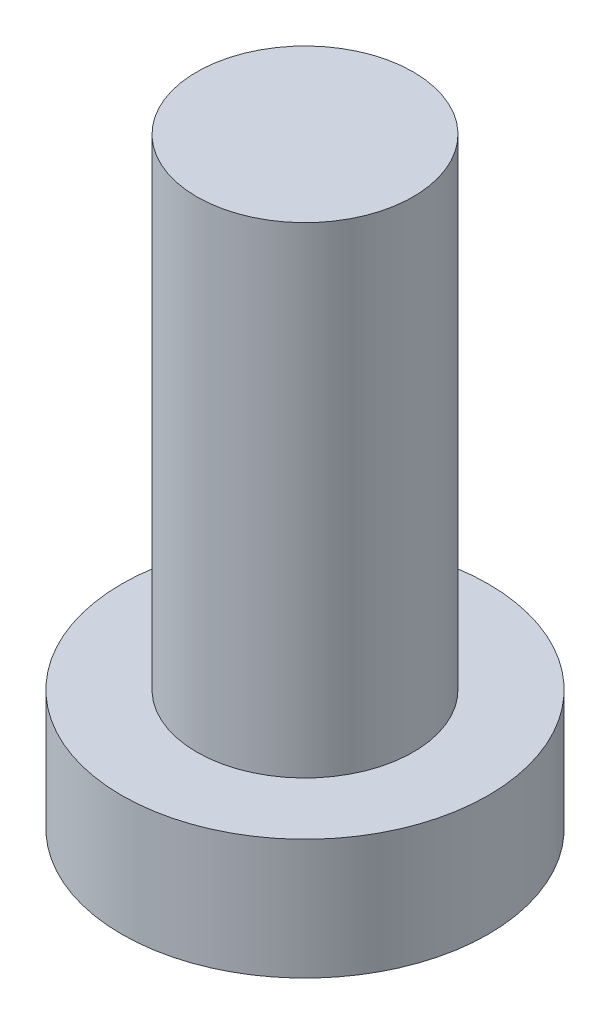
ISO-10303-21;
HEADER;
FILE_DESCRIPTION(('STEP AP214'),'2;1');
FILE_NAME('part.step','',(''),(''),'','','');
FILE_SCHEMA(('AUTOMOTIVE_DESIGN { 1 0 10303 214 1 1 1 1 }'));
ENDSEC;
DATA;
#1=APPLICATION_CONTEXT('core data for automotive mechanical design processes');
#2=APPLICATION_PROTOCOL_DEFINITION('international standard','automotive_design',2000,#1);
#3=PRODUCT_CONTEXT('',#1,'mechanical');
#4=PRODUCT('Part','Part','',(#3));
#5=PRODUCT_RELATED_PRODUCT_CATEGORY('part','',(#4));
#6=PRODUCT_DEFINITION_FORMATION('','',#4);
#7=PRODUCT_DEFINITION_CONTEXT('part definition',#1,'design');
#8=PRODUCT_DEFINITION('design','',#6,#7);
#9=PRODUCT_DEFINITION_SHAPE('','',#8);
#10=(LENGTH_UNIT() NAMED_UNIT(*) SI_UNIT(.MILLI.,.METRE.));
#11=(NAMED_UNIT(*) PLANE_ANGLE_UNIT() SI_UNIT($,.RADIAN.));
#12=(NAMED_UNIT(*) SI_UNIT($,.STERADIAN.) SOLID_ANGLE_UNIT());
#13=UNCERTAINTY_MEASURE_WITH_UNIT(LENGTH_MEASURE(1.E-05),#10,'distance_accuracy_value','');
#14=(GEOMETRIC_REPRESENTATION_CONTEXT(3) GLOBAL_UNCERTAINTY_ASSIGNED_CONTEXT((#13)) GLOBAL_UNIT_ASSIGNED_CONTEXT((#10,
#11,#12)) REPRESENTATION_CONTEXT('',''));
#15=CARTESIAN_POINT('',(0.,0.,0.));
#16=DIRECTION('',(0.,0.,1.));
#17=DIRECTION('',(1.,0.,0.));
#18=AXIS2_PLACEMENT_3D('',#15,#16,#17);
#19=CARTESIAN_POINT('',(0.,2.5,0.));
#20=DIRECTION('',(0.,-1.,0.));
#21=DIRECTION('',(0.,0.,-1.));
#22=AXIS2_PLACEMENT_3D('',#19,#20,#21);
#23=CYLINDRICAL_SURFACE('',#22,3.81);
#24=CARTESIAN_POINT('',(0.,2.5,0.));
#25=DIRECTION('',(0.,1.,0.));
#26=DIRECTION('',(0.,0.,1.));
#27=AXIS2_PLACEMENT_3D('',#24,#25,#26);
#28=CIRCLE('',#27,3.81);
#29=CARTESIAN_POINT('',(0.,2.5,3.81));
#30=VERTEX_POINT('',#29);
#31=EDGE_CURVE('E51',#30,#30,#28,.T.);
#32=ORIENTED_EDGE('',*,*,#31,.F.);
#33=EDGE_LOOP('',(#32));
#34=FACE_BOUND('',#33,.T.);
#35=CARTESIAN_POINT('',(0.,0.,0.));
#36=DIRECTION('',(0.,1.,0.));
#37=DIRECTION('',(0.,0.,1.));
#38=AXIS2_PLACEMENT_3D('',#35,#36,#37);
#39=CIRCLE('',#38,3.81);
#40=CARTESIAN_POINT('',(0.,0.,3.81));
#41=VERTEX_POINT('',#40);
#42=EDGE_CURVE('E46',#41,#41,#39,.T.);
#43=ORIENTED_EDGE('',*,*,#42,.T.);
#44=EDGE_LOOP('',(#43));
#45=FACE_BOUND('',#44,.T.);
#46=ADVANCED_FACE('F43',(#34,#45),#23,.T.);
#47=CARTESIAN_POINT('',(0.,2.5,0.));
#48=DIRECTION('',(0.,1.,0.));
#49=DIRECTION('',(0.,0.,1.));
#50=AXIS2_PLACEMENT_3D('',#47,#48,#49);
#51=PLANE('',#50);
#52=CARTESIAN_POINT('',(0.,2.5,0.));
#53=DIRECTION('',(0.,1.,0.));
#54=DIRECTION('',(0.,0.,1.));
#55=AXIS2_PLACEMENT_3D('',#52,#53,#54);
#56=CIRCLE('',#55,2.25);
#57=CARTESIAN_POINT('',(0.,2.5,2.25));
#58=VERTEX_POINT('',#57);
#59=EDGE_CURVE('E10',#58,#58,#56,.T.);
#60=ORIENTED_EDGE('',*,*,#59,.F.);
#61=EDGE_LOOP('',(#60));
#62=FACE_BOUND('',#61,.T.);
#63=ORIENTED_EDGE('',*,*,#31,.T.);
#64=EDGE_LOOP('',(#63));
#65=FACE_BOUND('',#64,.T.);
#66=ADVANCED_FACE('F71',(#62,#65),#51,.T.);
#67=CARTESIAN_POINT('',(0.,0.,0.));
#68=DIRECTION('',(0.,1.,0.));
#69=DIRECTION('',(0.,0.,1.));
#70=AXIS2_PLACEMENT_3D('',#67,#68,#69);
#71=PLANE('',#70);
#72=ORIENTED_EDGE('',*,*,#42,.F.);
#73=EDGE_LOOP('',(#72));
#74=FACE_BOUND('',#73,.T.);
#75=ADVANCED_FACE('F68',(#74),#71,.F.);
#76=CARTESIAN_POINT('',(0.,12.5,0.));
#77=DIRECTION('',(0.,-1.,0.));
#78=DIRECTION('',(0.,0.,-1.));
#79=AXIS2_PLACEMENT_3D('',#76,#77,#78);
#80=CYLINDRICAL_SURFACE('',#79,2.25);
#81=CARTESIAN_POINT('',(0.,12.5,0.));
#82=DIRECTION('',(0.,1.,0.));
#83=DIRECTION('',(0.,0.,1.));
#84=AXIS2_PLACEMENT_3D('',#81,#82,#83);
#85=CIRCLE('',#84,2.25);
#86=CARTESIAN_POINT('',(0.,12.5,2.25));
#87=VERTEX_POINT('',#86);
#88=EDGE_CURVE('E58',#87,#87,#85,.T.);
#89=ORIENTED_EDGE('',*,*,#88,.F.);
#90=EDGE_LOOP('',(#89));
#91=FACE_BOUND('',#90,.T.);
#92=ORIENTED_EDGE('',*,*,#59,.T.);
#93=EDGE_LOOP('',(#92));
#94=FACE_BOUND('',#93,.T.);
#95=ADVANCED_FACE('F70',(#91,#94),#80,.T.);
#96=CARTESIAN_POINT('',(0.,12.5,0.));
#97=DIRECTION('',(0.,1.,0.));
#98=DIRECTION('',(0.,0.,1.));
#99=AXIS2_PLACEMENT_3D('',#96,#97,#98);
#100=PLANE('',#99);
#101=ORIENTED_EDGE('',*,*,#88,.T.);
#102=EDGE_LOOP('',(#101));
#103=FACE_BOUND('',#102,.T.);
#104=ADVANCED_FACE('F77',(#103),#100,.T.);
#105=CLOSED_SHELL('',(#46,#66,#75,#95,#104));
#106=MANIFOLD_SOLID_BREP('B2',#105);
#107=ADVANCED_BREP_SHAPE_REPRESENTATION('',(#18,#106),#14);
#108=SHAPE_DEFINITION_REPRESENTATION(#9,#107);
ENDSEC;
END-ISO-10303-21;
